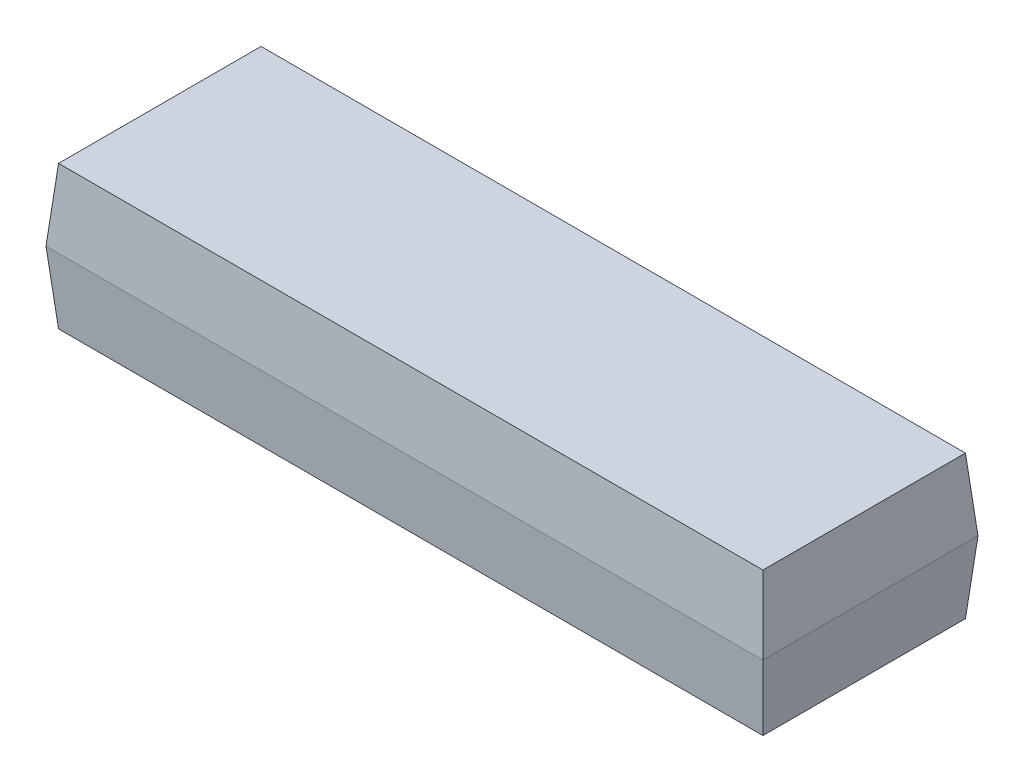
ISO-10303-21;
HEADER;
FILE_DESCRIPTION(('STEP AP214'),'2;1');
FILE_NAME('part.step','',(''),(''),'','','');
FILE_SCHEMA(('AUTOMOTIVE_DESIGN { 1 0 10303 214 1 1 1 1 }'));
ENDSEC;
DATA;
#1=APPLICATION_CONTEXT('core data for automotive mechanical design processes');
#2=APPLICATION_PROTOCOL_DEFINITION('international standard','automotive_design',2000,#1);
#3=PRODUCT_CONTEXT('',#1,'mechanical');
#4=PRODUCT('Part','Part','',(#3));
#5=PRODUCT_RELATED_PRODUCT_CATEGORY('part','',(#4));
#6=PRODUCT_DEFINITION_FORMATION('','',#4);
#7=PRODUCT_DEFINITION_CONTEXT('part definition',#1,'design');
#8=PRODUCT_DEFINITION('design','',#6,#7);
#9=PRODUCT_DEFINITION_SHAPE('','',#8);
#10=(LENGTH_UNIT() NAMED_UNIT(*) SI_UNIT(.MILLI.,.METRE.));
#11=(NAMED_UNIT(*) PLANE_ANGLE_UNIT() SI_UNIT($,.RADIAN.));
#12=(NAMED_UNIT(*) SI_UNIT($,.STERADIAN.) SOLID_ANGLE_UNIT());
#13=UNCERTAINTY_MEASURE_WITH_UNIT(LENGTH_MEASURE(1.E-05),#10,'distance_accuracy_value','');
#14=(GEOMETRIC_REPRESENTATION_CONTEXT(3) GLOBAL_UNCERTAINTY_ASSIGNED_CONTEXT((#13)) GLOBAL_UNIT_ASSIGNED_CONTEXT((#10,
#11,#12)) REPRESENTATION_CONTEXT('',''));
#15=CARTESIAN_POINT('',(0.,0.,0.));
#16=DIRECTION('',(0.,0.,1.));
#17=DIRECTION('',(1.,0.,0.));
#18=AXIS2_PLACEMENT_3D('',#15,#16,#17);
#19=CARTESIAN_POINT('',(5.,0.,1.5));
#20=DIRECTION('',(0.996194698091746,-0.0871557427476584,0.));
#21=DIRECTION('',(0.0871557427476584,0.996194698091746,0.));
#22=AXIS2_PLACEMENT_3D('',#19,#20,#21);
#23=PLANE('',#22);
#24=DIRECTION('',(0.,0.,-1.));
#25=VECTOR('',#24,1.);
#26=CARTESIAN_POINT('',(5.,0.,1.5));
#27=LINE('',#26,#25);
#28=CARTESIAN_POINT('',(5.,0.,1.5));
#29=VERTEX_POINT('',#28);
#30=CARTESIAN_POINT('',(5.,0.,-1.5));
#31=VERTEX_POINT('',#30);
#32=EDGE_CURVE('E102',#29,#31,#27,.T.);
#33=ORIENTED_EDGE('',*,*,#32,.F.);
#34=DIRECTION('',(0.0868265938642478,0.992432509138967,0.0868265938642478));
#35=VECTOR('',#34,1.);
#36=CARTESIAN_POINT('',(4.92461142597933,-0.861695344086855,1.42461142597933));
#37=LINE('',#36,#35);
#38=CARTESIAN_POINT('',(4.91251133647408,-1.,1.41251133647408));
#39=VERTEX_POINT('',#38);
#40=EDGE_CURVE('E11',#39,#29,#37,.T.);
#41=ORIENTED_EDGE('',*,*,#40,.F.);
#42=DIRECTION('',(0.,0.,-1.));
#43=VECTOR('',#42,1.);
#44=CARTESIAN_POINT('',(4.91251133647408,-1.,1.5));
#45=LINE('',#44,#43);
#46=CARTESIAN_POINT('',(4.91251133647408,-1.,-1.41251133647408));
#47=VERTEX_POINT('',#46);
#48=EDGE_CURVE('E125',#39,#47,#45,.T.);
#49=ORIENTED_EDGE('',*,*,#48,.T.);
#50=DIRECTION('',(0.0868265938642478,0.992432509138967,-0.0868265938642478));
#51=VECTOR('',#50,1.);
#52=CARTESIAN_POINT('',(4.9773834277938,-0.258508603226056,-1.4773834277938));
#53=LINE('',#52,#51);
#54=EDGE_CURVE('E80',#47,#31,#53,.T.);
#55=ORIENTED_EDGE('',*,*,#54,.T.);
#56=EDGE_LOOP('',(#33,#41,#49,#55));
#57=FACE_BOUND('',#56,.T.);
#58=ADVANCED_FACE('F43',(#57),#23,.T.);
#59=CARTESIAN_POINT('',(-5.,0.,1.5));
#60=DIRECTION('',(0.,-0.0871557427476584,0.996194698091746));
#61=DIRECTION('',(0.,-0.996194698091746,-0.0871557427476584));
#62=AXIS2_PLACEMENT_3D('',#59,#60,#61);
#63=PLANE('',#62);
#64=DIRECTION('',(1.,0.,0.));
#65=VECTOR('',#64,1.);
#66=CARTESIAN_POINT('',(-5.,0.,1.5));
#67=LINE('',#66,#65);
#68=CARTESIAN_POINT('',(-5.,0.,1.5));
#69=VERTEX_POINT('',#68);
#70=EDGE_CURVE('E112',#69,#29,#67,.T.);
#71=ORIENTED_EDGE('',*,*,#70,.F.);
#72=DIRECTION('',(-0.0868265938642478,0.992432509138967,0.0868265938642478));
#73=VECTOR('',#72,1.);
#74=CARTESIAN_POINT('',(-5.,0.,1.5));
#75=LINE('',#74,#73);
#76=CARTESIAN_POINT('',(-4.91251133647407,-1.,1.41251133647408));
#77=VERTEX_POINT('',#76);
#78=EDGE_CURVE('E53',#77,#69,#75,.T.);
#79=ORIENTED_EDGE('',*,*,#78,.F.);
#80=DIRECTION('',(1.,0.,0.));
#81=VECTOR('',#80,1.);
#82=CARTESIAN_POINT('',(-5.,-1.,1.41251133647408));
#83=LINE('',#82,#81);
#84=EDGE_CURVE('E115',#77,#39,#83,.T.);
#85=ORIENTED_EDGE('',*,*,#84,.T.);
#86=ORIENTED_EDGE('',*,*,#40,.T.);
#87=EDGE_LOOP('',(#71,#79,#85,#86));
#88=FACE_BOUND('',#87,.T.);
#89=ADVANCED_FACE('F45',(#88),#63,.T.);
#90=CARTESIAN_POINT('',(-5.,0.,1.5));
#91=DIRECTION('',(-0.996194698091746,-0.0871557427476584,0.));
#92=DIRECTION('',(0.0871557427476584,-0.996194698091746,0.));
#93=AXIS2_PLACEMENT_3D('',#90,#91,#92);
#94=PLANE('',#93);
#95=DIRECTION('',(0.,0.,1.));
#96=VECTOR('',#95,1.);
#97=CARTESIAN_POINT('',(-5.,0.,1.5));
#98=LINE('',#97,#96);
#99=CARTESIAN_POINT('',(-5.,0.,-1.5));
#100=VERTEX_POINT('',#99);
#101=EDGE_CURVE('E126',#100,#69,#98,.T.);
#102=ORIENTED_EDGE('',*,*,#101,.F.);
#103=DIRECTION('',(-0.0868265938642478,0.992432509138967,-0.0868265938642478));
#104=VECTOR('',#103,1.);
#105=CARTESIAN_POINT('',(-5.,0.,-1.5));
#106=LINE('',#105,#104);
#107=CARTESIAN_POINT('',(-4.91251133647407,-1.,-1.41251133647408));
#108=VERTEX_POINT('',#107);
#109=EDGE_CURVE('E73',#108,#100,#106,.T.);
#110=ORIENTED_EDGE('',*,*,#109,.F.);
#111=DIRECTION('',(0.,0.,1.));
#112=VECTOR('',#111,1.);
#113=CARTESIAN_POINT('',(-4.91251133647407,-1.,1.5));
#114=LINE('',#113,#112);
#115=EDGE_CURVE('E152',#108,#77,#114,.T.);
#116=ORIENTED_EDGE('',*,*,#115,.T.);
#117=ORIENTED_EDGE('',*,*,#78,.T.);
#118=EDGE_LOOP('',(#102,#110,#116,#117));
#119=FACE_BOUND('',#118,.T.);
#120=ADVANCED_FACE('F164',(#119),#94,.T.);
#121=CARTESIAN_POINT('',(-5.,0.,-1.5));
#122=DIRECTION('',(0.,-0.0871557427476584,-0.996194698091746));
#123=DIRECTION('',(0.,0.996194698091746,-0.0871557427476584));
#124=AXIS2_PLACEMENT_3D('',#121,#122,#123);
#125=PLANE('',#124);
#126=DIRECTION('',(-1.,0.,0.));
#127=VECTOR('',#126,1.);
#128=CARTESIAN_POINT('',(-5.,0.,-1.5));
#129=LINE('',#128,#127);
#130=EDGE_CURVE('E106',#31,#100,#129,.T.);
#131=ORIENTED_EDGE('',*,*,#130,.F.);
#132=ORIENTED_EDGE('',*,*,#54,.F.);
#133=DIRECTION('',(-1.,0.,0.));
#134=VECTOR('',#133,1.);
#135=CARTESIAN_POINT('',(-5.,-1.,-1.41251133647408));
#136=LINE('',#135,#134);
#137=EDGE_CURVE('E47',#47,#108,#136,.T.);
#138=ORIENTED_EDGE('',*,*,#137,.T.);
#139=ORIENTED_EDGE('',*,*,#109,.T.);
#140=EDGE_LOOP('',(#131,#132,#138,#139));
#141=FACE_BOUND('',#140,.T.);
#142=ADVANCED_FACE('F153',(#141),#125,.T.);
#143=CARTESIAN_POINT('',(0.,-1.,0.));
#144=DIRECTION('',(0.,-1.,0.));
#145=DIRECTION('',(0.,0.,-1.));
#146=AXIS2_PLACEMENT_3D('',#143,#144,#145);
#147=PLANE('',#146);
#148=ORIENTED_EDGE('',*,*,#48,.F.);
#149=ORIENTED_EDGE('',*,*,#84,.F.);
#150=ORIENTED_EDGE('',*,*,#115,.F.);
#151=ORIENTED_EDGE('',*,*,#137,.F.);
#152=EDGE_LOOP('',(#148,#149,#150,#151));
#153=FACE_BOUND('',#152,.T.);
#154=ADVANCED_FACE('F155',(#153),#147,.T.);
#155=CARTESIAN_POINT('',(5.,0.,1.5));
#156=DIRECTION('',(0.996194698091746,0.0871557427476584,0.));
#157=DIRECTION('',(-0.0871557427476584,0.996194698091746,0.));
#158=AXIS2_PLACEMENT_3D('',#155,#156,#157);
#159=PLANE('',#158);
#160=ORIENTED_EDGE('',*,*,#32,.T.);
#161=DIRECTION('',(0.0868265938642478,-0.992432509138967,-0.0868265938642478));
#162=VECTOR('',#161,1.);
#163=CARTESIAN_POINT('',(4.92461142597933,0.861695344086855,-1.42461142597933));
#164=LINE('',#163,#162);
#165=CARTESIAN_POINT('',(4.91251133647408,1.,-1.41251133647408));
#166=VERTEX_POINT('',#165);
#167=EDGE_CURVE('E107',#166,#31,#164,.T.);
#168=ORIENTED_EDGE('',*,*,#167,.F.);
#169=DIRECTION('',(0.,0.,1.));
#170=VECTOR('',#169,1.);
#171=CARTESIAN_POINT('',(4.91251133647408,1.,0.));
#172=LINE('',#171,#170);
#173=CARTESIAN_POINT('',(4.91251133647408,1.,1.41251133647408));
#174=VERTEX_POINT('',#173);
#175=EDGE_CURVE('E130',#174,#166,#172,.F.);
#176=ORIENTED_EDGE('',*,*,#175,.F.);
#177=DIRECTION('',(0.0868265938642478,-0.992432509138967,0.0868265938642478));
#178=VECTOR('',#177,1.);
#179=CARTESIAN_POINT('',(5.,0.,1.5));
#180=LINE('',#179,#178);
#181=EDGE_CURVE('E121',#174,#29,#180,.T.);
#182=ORIENTED_EDGE('',*,*,#181,.T.);
#183=EDGE_LOOP('',(#160,#168,#176,#182));
#184=FACE_BOUND('',#183,.T.);
#185=ADVANCED_FACE('F128',(#184),#159,.T.);
#186=CARTESIAN_POINT('',(-5.,0.,-1.5));
#187=DIRECTION('',(0.,0.0871557427476584,-0.996194698091746));
#188=DIRECTION('',(0.,0.996194698091746,0.0871557427476584));
#189=AXIS2_PLACEMENT_3D('',#186,#187,#188);
#190=PLANE('',#189);
#191=ORIENTED_EDGE('',*,*,#130,.T.);
#192=DIRECTION('',(-0.0868265938642478,-0.992432509138967,-0.0868265938642478));
#193=VECTOR('',#192,1.);
#194=CARTESIAN_POINT('',(-4.9773834277938,0.258508603226056,-1.4773834277938));
#195=LINE('',#194,#193);
#196=CARTESIAN_POINT('',(-4.91251133647407,1.,-1.41251133647408));
#197=VERTEX_POINT('',#196);
#198=EDGE_CURVE('E133',#197,#100,#195,.T.);
#199=ORIENTED_EDGE('',*,*,#198,.F.);
#200=DIRECTION('',(1.,0.,0.));
#201=VECTOR('',#200,1.);
#202=CARTESIAN_POINT('',(0.,1.,-1.41251133647408));
#203=LINE('',#202,#201);
#204=EDGE_CURVE('E142',#166,#197,#203,.F.);
#205=ORIENTED_EDGE('',*,*,#204,.F.);
#206=ORIENTED_EDGE('',*,*,#167,.T.);
#207=EDGE_LOOP('',(#191,#199,#205,#206));
#208=FACE_BOUND('',#207,.T.);
#209=ADVANCED_FACE('F162',(#208),#190,.T.);
#210=CARTESIAN_POINT('',(-5.,0.,1.5));
#211=DIRECTION('',(-0.996194698091746,0.0871557427476584,0.));
#212=DIRECTION('',(-0.0871557427476584,-0.996194698091746,0.));
#213=AXIS2_PLACEMENT_3D('',#210,#211,#212);
#214=PLANE('',#213);
#215=ORIENTED_EDGE('',*,*,#101,.T.);
#216=DIRECTION('',(-0.0868265938642478,-0.992432509138967,0.0868265938642478));
#217=VECTOR('',#216,1.);
#218=CARTESIAN_POINT('',(-5.,0.,1.5));
#219=LINE('',#218,#217);
#220=CARTESIAN_POINT('',(-4.91251133647407,1.,1.41251133647408));
#221=VERTEX_POINT('',#220);
#222=EDGE_CURVE('E124',#221,#69,#219,.T.);
#223=ORIENTED_EDGE('',*,*,#222,.F.);
#224=DIRECTION('',(0.,0.,-1.));
#225=VECTOR('',#224,1.);
#226=CARTESIAN_POINT('',(-4.91251133647407,1.,0.));
#227=LINE('',#226,#225);
#228=EDGE_CURVE('E135',#197,#221,#227,.F.);
#229=ORIENTED_EDGE('',*,*,#228,.F.);
#230=ORIENTED_EDGE('',*,*,#198,.T.);
#231=EDGE_LOOP('',(#215,#223,#229,#230));
#232=FACE_BOUND('',#231,.T.);
#233=ADVANCED_FACE('F180',(#232),#214,.T.);
#234=CARTESIAN_POINT('',(-5.,0.,1.5));
#235=DIRECTION('',(0.,0.0871557427476584,0.996194698091746));
#236=DIRECTION('',(0.,-0.996194698091746,0.0871557427476584));
#237=AXIS2_PLACEMENT_3D('',#234,#235,#236);
#238=PLANE('',#237);
#239=ORIENTED_EDGE('',*,*,#70,.T.);
#240=ORIENTED_EDGE('',*,*,#181,.F.);
#241=DIRECTION('',(-1.,0.,0.));
#242=VECTOR('',#241,1.);
#243=CARTESIAN_POINT('',(0.,1.,1.41251133647408));
#244=LINE('',#243,#242);
#245=EDGE_CURVE('E131',#221,#174,#244,.F.);
#246=ORIENTED_EDGE('',*,*,#245,.F.);
#247=ORIENTED_EDGE('',*,*,#222,.T.);
#248=EDGE_LOOP('',(#239,#240,#246,#247));
#249=FACE_BOUND('',#248,.T.);
#250=ADVANCED_FACE('F119',(#249),#238,.T.);
#251=CARTESIAN_POINT('',(0.,1.,0.));
#252=DIRECTION('',(0.,-1.,0.));
#253=DIRECTION('',(0.,0.,-1.));
#254=AXIS2_PLACEMENT_3D('',#251,#252,#253);
#255=PLANE('',#254);
#256=ORIENTED_EDGE('',*,*,#175,.T.);
#257=ORIENTED_EDGE('',*,*,#204,.T.);
#258=ORIENTED_EDGE('',*,*,#228,.T.);
#259=ORIENTED_EDGE('',*,*,#245,.T.);
#260=EDGE_LOOP('',(#256,#257,#258,#259));
#261=FACE_BOUND('',#260,.T.);
#262=ADVANCED_FACE('F182',(#261),#255,.F.);
#263=CLOSED_SHELL('',(#58,#89,#120,#142,#154,#185,#209,#233,#250,#262));
#264=MANIFOLD_SOLID_BREP('B2',#263);
#265=ADVANCED_BREP_SHAPE_REPRESENTATION('',(#18,#264),#14);
#266=SHAPE_DEFINITION_REPRESENTATION(#9,#265);
ENDSEC;
END-ISO-10303-21;
